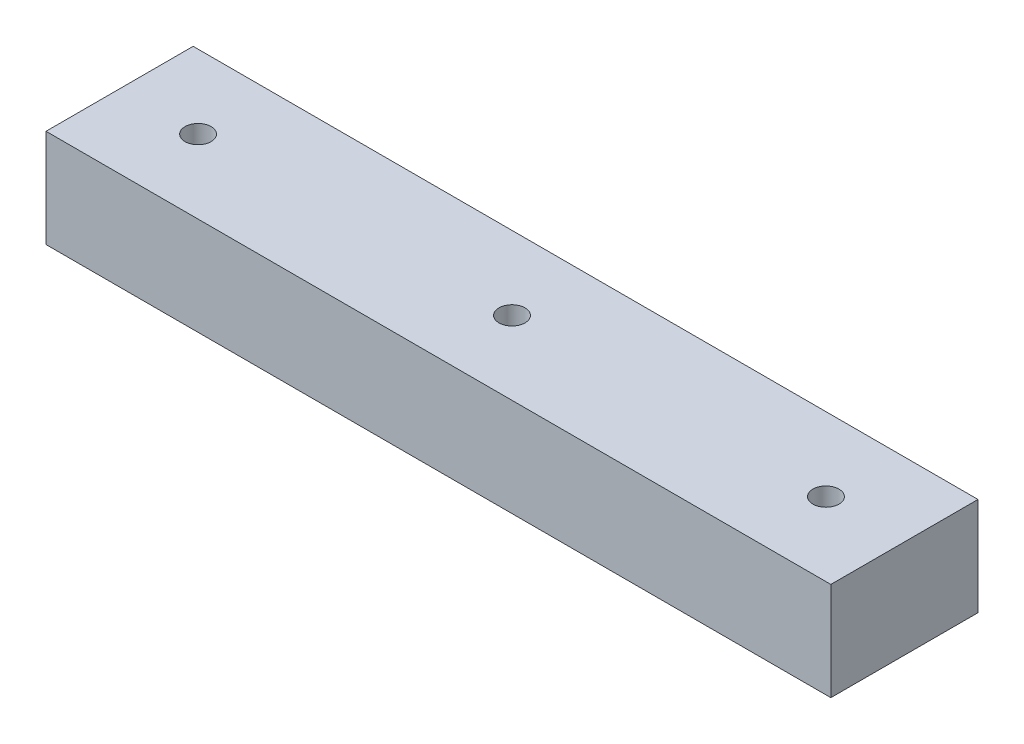
ISO-10303-21;
HEADER;
FILE_DESCRIPTION(('STEP AP214'),'2;1');
FILE_NAME('part.step','',(''),(''),'','','');
FILE_SCHEMA(('AUTOMOTIVE_DESIGN { 1 0 10303 214 1 1 1 1 }'));
ENDSEC;
DATA;
#1=APPLICATION_CONTEXT('core data for automotive mechanical design processes');
#2=APPLICATION_PROTOCOL_DEFINITION('international standard','automotive_design',2000,#1);
#3=PRODUCT_CONTEXT('',#1,'mechanical');
#4=PRODUCT('Part','Part','',(#3));
#5=PRODUCT_RELATED_PRODUCT_CATEGORY('part','',(#4));
#6=PRODUCT_DEFINITION_FORMATION('','',#4);
#7=PRODUCT_DEFINITION_CONTEXT('part definition',#1,'design');
#8=PRODUCT_DEFINITION('design','',#6,#7);
#9=PRODUCT_DEFINITION_SHAPE('','',#8);
#10=(LENGTH_UNIT() NAMED_UNIT(*) SI_UNIT(.MILLI.,.METRE.));
#11=(NAMED_UNIT(*) PLANE_ANGLE_UNIT() SI_UNIT($,.RADIAN.));
#12=(NAMED_UNIT(*) SI_UNIT($,.STERADIAN.) SOLID_ANGLE_UNIT());
#13=UNCERTAINTY_MEASURE_WITH_UNIT(LENGTH_MEASURE(1.E-05),#10,'distance_accuracy_value','');
#14=(GEOMETRIC_REPRESENTATION_CONTEXT(3) GLOBAL_UNCERTAINTY_ASSIGNED_CONTEXT((#13)) GLOBAL_UNIT_ASSIGNED_CONTEXT((#10,
#11,#12)) REPRESENTATION_CONTEXT('',''));
#15=CARTESIAN_POINT('',(0.,0.,0.));
#16=DIRECTION('',(0.,0.,1.));
#17=DIRECTION('',(1.,0.,0.));
#18=AXIS2_PLACEMENT_3D('',#15,#16,#17);
#19=CARTESIAN_POINT('',(101.6,25.4,19.05));
#20=DIRECTION('',(-1.,0.,0.));
#21=DIRECTION('',(0.,0.,1.));
#22=AXIS2_PLACEMENT_3D('',#19,#20,#21);
#23=PLANE('',#22);
#24=DIRECTION('',(0.,0.,-1.));
#25=VECTOR('',#24,1.);
#26=CARTESIAN_POINT('',(101.6,0.,19.05));
#27=LINE('',#26,#25);
#28=CARTESIAN_POINT('',(101.6,0.,19.05));
#29=VERTEX_POINT('',#28);
#30=CARTESIAN_POINT('',(101.6,0.,-19.05));
#31=VERTEX_POINT('',#30);
#32=EDGE_CURVE('E95',#29,#31,#27,.T.);
#33=ORIENTED_EDGE('',*,*,#32,.T.);
#34=DIRECTION('',(0.,-1.,0.));
#35=VECTOR('',#34,1.);
#36=CARTESIAN_POINT('',(101.6,25.4,-19.05));
#37=LINE('',#36,#35);
#38=CARTESIAN_POINT('',(101.6,25.4,-19.05));
#39=VERTEX_POINT('',#38);
#40=EDGE_CURVE('E11',#39,#31,#37,.T.);
#41=ORIENTED_EDGE('',*,*,#40,.F.);
#42=DIRECTION('',(0.,0.,-1.));
#43=VECTOR('',#42,1.);
#44=CARTESIAN_POINT('',(101.6,25.4,19.05));
#45=LINE('',#44,#43);
#46=CARTESIAN_POINT('',(101.6,25.4,19.05));
#47=VERTEX_POINT('',#46);
#48=EDGE_CURVE('E83',#47,#39,#45,.T.);
#49=ORIENTED_EDGE('',*,*,#48,.F.);
#50=DIRECTION('',(0.,-1.,0.));
#51=VECTOR('',#50,1.);
#52=CARTESIAN_POINT('',(101.6,25.4,19.05));
#53=LINE('',#52,#51);
#54=EDGE_CURVE('E91',#47,#29,#53,.T.);
#55=ORIENTED_EDGE('',*,*,#54,.T.);
#56=EDGE_LOOP('',(#33,#41,#49,#55));
#57=FACE_BOUND('',#56,.T.);
#58=ADVANCED_FACE('F32',(#57),#23,.F.);
#59=CARTESIAN_POINT('',(-101.6,25.4,-19.05));
#60=DIRECTION('',(0.,0.,1.));
#61=DIRECTION('',(1.,0.,0.));
#62=AXIS2_PLACEMENT_3D('',#59,#60,#61);
#63=PLANE('',#62);
#64=DIRECTION('',(-1.,0.,0.));
#65=VECTOR('',#64,1.);
#66=CARTESIAN_POINT('',(-101.6,0.,-19.05));
#67=LINE('',#66,#65);
#68=CARTESIAN_POINT('',(-101.6,0.,-19.05));
#69=VERTEX_POINT('',#68);
#70=EDGE_CURVE('E87',#31,#69,#67,.T.);
#71=ORIENTED_EDGE('',*,*,#70,.T.);
#72=DIRECTION('',(0.,-1.,0.));
#73=VECTOR('',#72,1.);
#74=CARTESIAN_POINT('',(-101.6,25.4,-19.05));
#75=LINE('',#74,#73);
#76=CARTESIAN_POINT('',(-101.6,25.4,-19.05));
#77=VERTEX_POINT('',#76);
#78=EDGE_CURVE('E40',#77,#69,#75,.T.);
#79=ORIENTED_EDGE('',*,*,#78,.F.);
#80=DIRECTION('',(-1.,0.,0.));
#81=VECTOR('',#80,1.);
#82=CARTESIAN_POINT('',(-101.6,25.4,-19.05));
#83=LINE('',#82,#81);
#84=EDGE_CURVE('E78',#39,#77,#83,.T.);
#85=ORIENTED_EDGE('',*,*,#84,.F.);
#86=ORIENTED_EDGE('',*,*,#40,.T.);
#87=EDGE_LOOP('',(#71,#79,#85,#86));
#88=FACE_BOUND('',#87,.T.);
#89=ADVANCED_FACE('F86',(#88),#63,.F.);
#90=CARTESIAN_POINT('',(-101.6,25.4,19.05));
#91=DIRECTION('',(1.,0.,0.));
#92=DIRECTION('',(0.,0.,-1.));
#93=AXIS2_PLACEMENT_3D('',#90,#91,#92);
#94=PLANE('',#93);
#95=DIRECTION('',(0.,0.,1.));
#96=VECTOR('',#95,1.);
#97=CARTESIAN_POINT('',(-101.6,0.,19.05));
#98=LINE('',#97,#96);
#99=CARTESIAN_POINT('',(-101.6,0.,19.05));
#100=VERTEX_POINT('',#99);
#101=EDGE_CURVE('E65',#69,#100,#98,.T.);
#102=ORIENTED_EDGE('',*,*,#101,.T.);
#103=DIRECTION('',(0.,-1.,0.));
#104=VECTOR('',#103,1.);
#105=CARTESIAN_POINT('',(-101.6,25.4,19.05));
#106=LINE('',#105,#104);
#107=CARTESIAN_POINT('',(-101.6,25.4,19.05));
#108=VERTEX_POINT('',#107);
#109=EDGE_CURVE('E88',#108,#100,#106,.T.);
#110=ORIENTED_EDGE('',*,*,#109,.F.);
#111=DIRECTION('',(0.,0.,1.));
#112=VECTOR('',#111,1.);
#113=CARTESIAN_POINT('',(-101.6,25.4,19.05));
#114=LINE('',#113,#112);
#115=EDGE_CURVE('E81',#77,#108,#114,.T.);
#116=ORIENTED_EDGE('',*,*,#115,.F.);
#117=ORIENTED_EDGE('',*,*,#78,.T.);
#118=EDGE_LOOP('',(#102,#110,#116,#117));
#119=FACE_BOUND('',#118,.T.);
#120=ADVANCED_FACE('F89',(#119),#94,.F.);
#121=CARTESIAN_POINT('',(-101.6,25.4,19.05));
#122=DIRECTION('',(0.,0.,-1.));
#123=DIRECTION('',(-1.,0.,0.));
#124=AXIS2_PLACEMENT_3D('',#121,#122,#123);
#125=PLANE('',#124);
#126=DIRECTION('',(1.,0.,0.));
#127=VECTOR('',#126,1.);
#128=CARTESIAN_POINT('',(-101.6,0.,19.05));
#129=LINE('',#128,#127);
#130=EDGE_CURVE('E71',#100,#29,#129,.T.);
#131=ORIENTED_EDGE('',*,*,#130,.T.);
#132=ORIENTED_EDGE('',*,*,#54,.F.);
#133=DIRECTION('',(1.,0.,0.));
#134=VECTOR('',#133,1.);
#135=CARTESIAN_POINT('',(-101.6,25.4,19.05));
#136=LINE('',#135,#134);
#137=EDGE_CURVE('E48',#108,#47,#136,.T.);
#138=ORIENTED_EDGE('',*,*,#137,.F.);
#139=ORIENTED_EDGE('',*,*,#109,.T.);
#140=EDGE_LOOP('',(#131,#132,#138,#139));
#141=FACE_BOUND('',#140,.T.);
#142=ADVANCED_FACE('F103',(#141),#125,.F.);
#143=CARTESIAN_POINT('',(0.,25.4,0.));
#144=DIRECTION('',(0.,-1.,0.));
#145=DIRECTION('',(0.,0.,-1.));
#146=AXIS2_PLACEMENT_3D('',#143,#144,#145);
#147=PLANE('',#146);
#148=CARTESIAN_POINT('',(81.28,25.4,0.));
#149=DIRECTION('',(0.,1.,0.));
#150=DIRECTION('',(0.,0.,-1.));
#151=AXIS2_PLACEMENT_3D('',#148,#149,#150);
#152=CIRCLE('',#151,3.37819999999999);
#153=CARTESIAN_POINT('',(81.28,25.4,-3.3782));
#154=VERTEX_POINT('',#153);
#155=EDGE_CURVE('E115',#154,#154,#152,.T.);
#156=ORIENTED_EDGE('',*,*,#155,.F.);
#157=EDGE_LOOP('',(#156));
#158=FACE_BOUND('',#157,.T.);
#159=CARTESIAN_POINT('',(-81.28,25.4,0.));
#160=DIRECTION('',(0.,1.,0.));
#161=DIRECTION('',(0.,0.,1.));
#162=AXIS2_PLACEMENT_3D('',#159,#160,#161);
#163=CIRCLE('',#162,3.37819999999999);
#164=CARTESIAN_POINT('',(-81.28,25.4,3.3782));
#165=VERTEX_POINT('',#164);
#166=EDGE_CURVE('E121',#165,#165,#163,.T.);
#167=ORIENTED_EDGE('',*,*,#166,.F.);
#168=EDGE_LOOP('',(#167));
#169=FACE_BOUND('',#168,.T.);
#170=CARTESIAN_POINT('',(0.,25.4,0.));
#171=DIRECTION('',(0.,1.,0.));
#172=DIRECTION('',(0.,0.,1.));
#173=AXIS2_PLACEMENT_3D('',#170,#171,#172);
#174=CIRCLE('',#173,3.3782);
#175=CARTESIAN_POINT('',(0.,25.4,3.3782));
#176=VERTEX_POINT('',#175);
#177=EDGE_CURVE('E109',#176,#176,#174,.T.);
#178=ORIENTED_EDGE('',*,*,#177,.F.);
#179=EDGE_LOOP('',(#178));
#180=FACE_BOUND('',#179,.T.);
#181=ORIENTED_EDGE('',*,*,#48,.T.);
#182=ORIENTED_EDGE('',*,*,#84,.T.);
#183=ORIENTED_EDGE('',*,*,#115,.T.);
#184=ORIENTED_EDGE('',*,*,#137,.T.);
#185=EDGE_LOOP('',(#181,#182,#183,#184));
#186=FACE_BOUND('',#185,.T.);
#187=ADVANCED_FACE('F79',(#158,#169,#180,#186),#147,.F.);
#188=CARTESIAN_POINT('',(0.,0.,0.));
#189=DIRECTION('',(0.,-1.,0.));
#190=DIRECTION('',(0.,0.,-1.));
#191=AXIS2_PLACEMENT_3D('',#188,#189,#190);
#192=PLANE('',#191);
#193=CARTESIAN_POINT('',(81.28,0.,0.));
#194=DIRECTION('',(0.,1.,0.));
#195=DIRECTION('',(0.,0.,-1.));
#196=AXIS2_PLACEMENT_3D('',#193,#194,#195);
#197=CIRCLE('',#196,3.37819999999999);
#198=CARTESIAN_POINT('',(81.28,0.,-3.3782));
#199=VERTEX_POINT('',#198);
#200=EDGE_CURVE('E118',#199,#199,#197,.T.);
#201=ORIENTED_EDGE('',*,*,#200,.T.);
#202=EDGE_LOOP('',(#201));
#203=FACE_BOUND('',#202,.T.);
#204=CARTESIAN_POINT('',(-81.28,0.,0.));
#205=DIRECTION('',(0.,1.,0.));
#206=DIRECTION('',(0.,0.,1.));
#207=AXIS2_PLACEMENT_3D('',#204,#205,#206);
#208=CIRCLE('',#207,3.37819999999999);
#209=CARTESIAN_POINT('',(-81.28,0.,3.3782));
#210=VERTEX_POINT('',#209);
#211=EDGE_CURVE('E112',#210,#210,#208,.T.);
#212=ORIENTED_EDGE('',*,*,#211,.T.);
#213=EDGE_LOOP('',(#212));
#214=FACE_BOUND('',#213,.T.);
#215=CARTESIAN_POINT('',(0.,0.,0.));
#216=DIRECTION('',(0.,1.,0.));
#217=DIRECTION('',(0.,0.,1.));
#218=AXIS2_PLACEMENT_3D('',#215,#216,#217);
#219=CIRCLE('',#218,3.3782);
#220=CARTESIAN_POINT('',(0.,0.,3.3782));
#221=VERTEX_POINT('',#220);
#222=EDGE_CURVE('E98',#221,#221,#219,.T.);
#223=ORIENTED_EDGE('',*,*,#222,.T.);
#224=EDGE_LOOP('',(#223));
#225=FACE_BOUND('',#224,.T.);
#226=ORIENTED_EDGE('',*,*,#32,.F.);
#227=ORIENTED_EDGE('',*,*,#130,.F.);
#228=ORIENTED_EDGE('',*,*,#101,.F.);
#229=ORIENTED_EDGE('',*,*,#70,.F.);
#230=EDGE_LOOP('',(#226,#227,#228,#229));
#231=FACE_BOUND('',#230,.T.);
#232=ADVANCED_FACE('F106',(#203,#214,#225,#231),#192,.T.);
#233=CARTESIAN_POINT('',(0.,0.,0.));
#234=DIRECTION('',(0.,1.,0.));
#235=DIRECTION('',(0.,0.,1.));
#236=AXIS2_PLACEMENT_3D('',#233,#234,#235);
#237=CYLINDRICAL_SURFACE('',#236,3.3782);
#238=ORIENTED_EDGE('',*,*,#222,.F.);
#239=EDGE_LOOP('',(#238));
#240=FACE_BOUND('',#239,.T.);
#241=ORIENTED_EDGE('',*,*,#177,.T.);
#242=EDGE_LOOP('',(#241));
#243=FACE_BOUND('',#242,.T.);
#244=ADVANCED_FACE('F133',(#240,#243),#237,.F.);
#245=CARTESIAN_POINT('',(-81.28,0.,0.));
#246=DIRECTION('',(0.,1.,0.));
#247=DIRECTION('',(0.,0.,1.));
#248=AXIS2_PLACEMENT_3D('',#245,#246,#247);
#249=CYLINDRICAL_SURFACE('',#248,3.37819999999999);
#250=ORIENTED_EDGE('',*,*,#211,.F.);
#251=EDGE_LOOP('',(#250));
#252=FACE_BOUND('',#251,.T.);
#253=ORIENTED_EDGE('',*,*,#166,.T.);
#254=EDGE_LOOP('',(#253));
#255=FACE_BOUND('',#254,.T.);
#256=ADVANCED_FACE('F129',(#252,#255),#249,.F.);
#257=CARTESIAN_POINT('',(81.28,0.,0.));
#258=DIRECTION('',(0.,1.,0.));
#259=DIRECTION('',(0.,0.,1.));
#260=AXIS2_PLACEMENT_3D('',#257,#258,#259);
#261=CYLINDRICAL_SURFACE('',#260,3.37819999999999);
#262=ORIENTED_EDGE('',*,*,#200,.F.);
#263=EDGE_LOOP('',(#262));
#264=FACE_BOUND('',#263,.T.);
#265=ORIENTED_EDGE('',*,*,#155,.T.);
#266=EDGE_LOOP('',(#265));
#267=FACE_BOUND('',#266,.T.);
#268=ADVANCED_FACE('F132',(#264,#267),#261,.F.);
#269=CLOSED_SHELL('',(#58,#89,#120,#142,#187,#232,#244,#256,#268));
#270=MANIFOLD_SOLID_BREP('B2',#269);
#271=ADVANCED_BREP_SHAPE_REPRESENTATION('',(#18,#270),#14);
#272=SHAPE_DEFINITION_REPRESENTATION(#9,#271);
ENDSEC;
END-ISO-10303-21;
